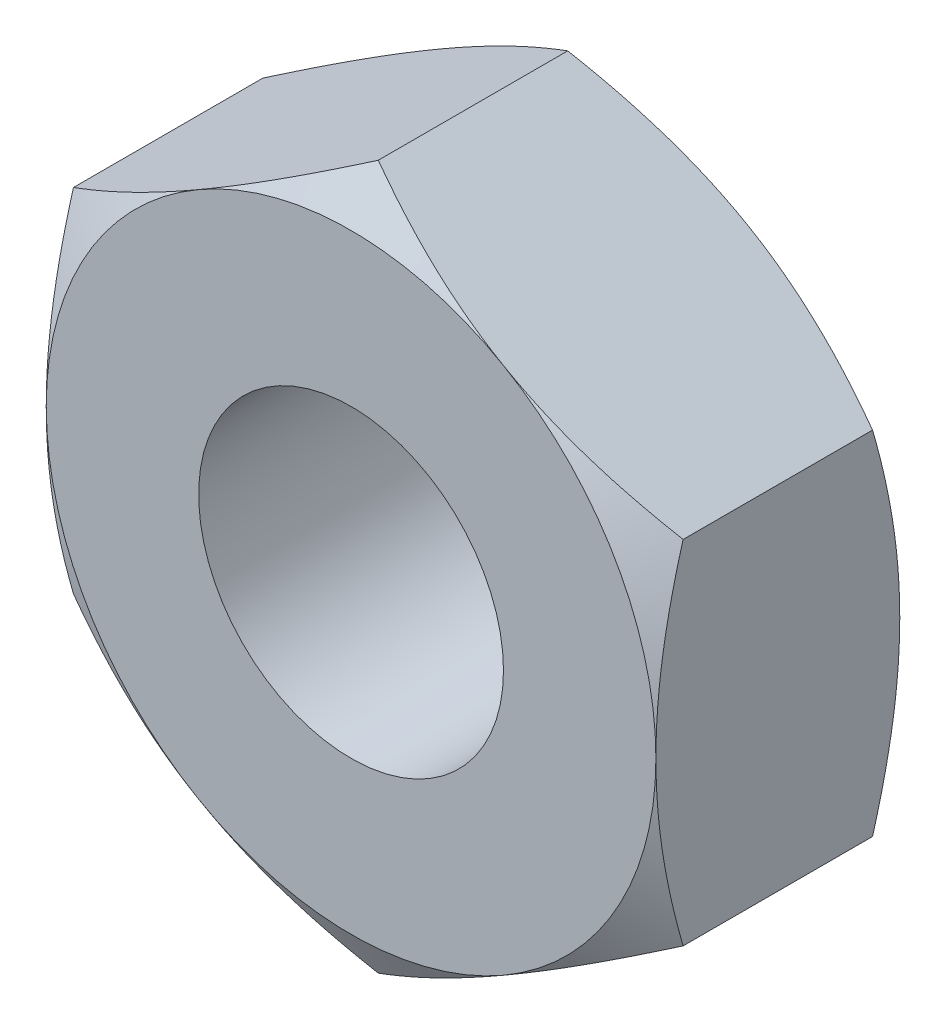
ISO-10303-21;
HEADER;
FILE_DESCRIPTION(('STEP AP214'),'2;1');
FILE_NAME('part.step','',(''),(''),'','','');
FILE_SCHEMA(('AUTOMOTIVE_DESIGN { 1 0 10303 214 1 1 1 1 }'));
ENDSEC;
DATA;
#1=APPLICATION_CONTEXT('core data for automotive mechanical design processes');
#2=APPLICATION_PROTOCOL_DEFINITION('international standard','automotive_design',2000,#1);
#3=PRODUCT_CONTEXT('',#1,'mechanical');
#4=PRODUCT('Part','Part','',(#3));
#5=PRODUCT_RELATED_PRODUCT_CATEGORY('part','',(#4));
#6=PRODUCT_DEFINITION_FORMATION('','',#4);
#7=PRODUCT_DEFINITION_CONTEXT('part definition',#1,'design');
#8=PRODUCT_DEFINITION('design','',#6,#7);
#9=PRODUCT_DEFINITION_SHAPE('','',#8);
#10=(LENGTH_UNIT() NAMED_UNIT(*) SI_UNIT(.MILLI.,.METRE.));
#11=(NAMED_UNIT(*) PLANE_ANGLE_UNIT() SI_UNIT($,.RADIAN.));
#12=(NAMED_UNIT(*) SI_UNIT($,.STERADIAN.) SOLID_ANGLE_UNIT());
#13=UNCERTAINTY_MEASURE_WITH_UNIT(LENGTH_MEASURE(1.E-05),#10,'distance_accuracy_value','');
#14=(GEOMETRIC_REPRESENTATION_CONTEXT(3) GLOBAL_UNCERTAINTY_ASSIGNED_CONTEXT((#13)) GLOBAL_UNIT_ASSIGNED_CONTEXT((#10,
#11,#12)) REPRESENTATION_CONTEXT('',''));
#15=CARTESIAN_POINT('',(0.,0.,0.));
#16=DIRECTION('',(0.,0.,1.));
#17=DIRECTION('',(1.,0.,0.));
#18=AXIS2_PLACEMENT_3D('',#15,#16,#17);
#19=CARTESIAN_POINT('',(0.,0.,-0.8));
#20=DIRECTION('',(0.,0.,1.));
#21=DIRECTION('',(1.,0.,0.));
#22=AXIS2_PLACEMENT_3D('',#19,#20,#21);
#23=PLANE('',#22);
#24=CARTESIAN_POINT('',(0.,0.,-0.8));
#25=DIRECTION('',(0.,0.,1.));
#26=DIRECTION('',(1.,0.,0.));
#27=AXIS2_PLACEMENT_3D('',#24,#25,#26);
#28=CIRCLE('',#27,1.);
#29=CARTESIAN_POINT('',(1.,0.,-0.8));
#30=VERTEX_POINT('',#29);
#31=EDGE_CURVE('E268',#30,#30,#28,.T.);
#32=ORIENTED_EDGE('',*,*,#31,.T.);
#33=EDGE_LOOP('',(#32));
#34=FACE_BOUND('',#33,.T.);
#35=CARTESIAN_POINT('',(0.,0.,-0.8));
#36=DIRECTION('',(0.,0.,1.));
#37=DIRECTION('',(1.,0.,0.));
#38=AXIS2_PLACEMENT_3D('',#35,#36,#37);
#39=CIRCLE('',#38,2.);
#40=CARTESIAN_POINT('',(2.,0.,-0.8));
#41=VERTEX_POINT('',#40);
#42=CARTESIAN_POINT('',(1.,1.73205080756888,-0.8));
#43=VERTEX_POINT('',#42);
#44=EDGE_CURVE('E148',#41,#43,#39,.T.);
#45=ORIENTED_EDGE('',*,*,#44,.F.);
#46=CARTESIAN_POINT('',(0.,0.,-0.8));
#47=DIRECTION('',(0.,0.,1.));
#48=DIRECTION('',(1.,0.,0.));
#49=AXIS2_PLACEMENT_3D('',#46,#47,#48);
#50=CIRCLE('',#49,2.);
#51=CARTESIAN_POINT('',(1.,-1.73205080756888,-0.8));
#52=VERTEX_POINT('',#51);
#53=EDGE_CURVE('E12',#41,#52,#50,.F.);
#54=ORIENTED_EDGE('',*,*,#53,.T.);
#55=CARTESIAN_POINT('',(-1.,-1.73205080756888,-0.8));
#56=VERTEX_POINT('',#55);
#57=EDGE_CURVE('E55',#52,#56,#50,.F.);
#58=ORIENTED_EDGE('',*,*,#57,.T.);
#59=CARTESIAN_POINT('',(-2.,0.,-0.8));
#60=VERTEX_POINT('',#59);
#61=EDGE_CURVE('E368',#56,#60,#50,.F.);
#62=ORIENTED_EDGE('',*,*,#61,.T.);
#63=CARTESIAN_POINT('',(-1.,1.73205080756888,-0.8));
#64=VERTEX_POINT('',#63);
#65=EDGE_CURVE('E157',#60,#64,#50,.F.);
#66=ORIENTED_EDGE('',*,*,#65,.T.);
#67=EDGE_CURVE('E56',#64,#43,#50,.F.);
#68=ORIENTED_EDGE('',*,*,#67,.T.);
#69=EDGE_LOOP('',(#45,#54,#58,#62,#66,#68));
#70=FACE_BOUND('',#69,.T.);
#71=ADVANCED_FACE('F45',(#34,#70),#23,.F.);
#72=CARTESIAN_POINT('',(0.,0.,0.8));
#73=DIRECTION('',(0.,0.,1.));
#74=DIRECTION('',(1.,0.,0.));
#75=AXIS2_PLACEMENT_3D('',#72,#73,#74);
#76=PLANE('',#75);
#77=CARTESIAN_POINT('',(0.,0.,0.8));
#78=DIRECTION('',(0.,0.,1.));
#79=DIRECTION('',(1.,0.,0.));
#80=AXIS2_PLACEMENT_3D('',#77,#78,#79);
#81=CIRCLE('',#80,1.);
#82=CARTESIAN_POINT('',(1.,0.,0.8));
#83=VERTEX_POINT('',#82);
#84=EDGE_CURVE('E272',#83,#83,#81,.T.);
#85=ORIENTED_EDGE('',*,*,#84,.F.);
#86=EDGE_LOOP('',(#85));
#87=FACE_BOUND('',#86,.T.);
#88=CARTESIAN_POINT('',(0.,0.,0.8));
#89=DIRECTION('',(0.,0.,1.));
#90=DIRECTION('',(1.,0.,0.));
#91=AXIS2_PLACEMENT_3D('',#88,#89,#90);
#92=CIRCLE('',#91,2.);
#93=CARTESIAN_POINT('',(1.,-1.73205080756888,0.8));
#94=VERTEX_POINT('',#93);
#95=CARTESIAN_POINT('',(2.,0.,0.8));
#96=VERTEX_POINT('',#95);
#97=EDGE_CURVE('E165',#94,#96,#92,.T.);
#98=ORIENTED_EDGE('',*,*,#97,.T.);
#99=CARTESIAN_POINT('',(1.,1.73205080756888,0.8));
#100=VERTEX_POINT('',#99);
#101=EDGE_CURVE('E170',#96,#100,#92,.T.);
#102=ORIENTED_EDGE('',*,*,#101,.T.);
#103=CARTESIAN_POINT('',(-1.,1.73205080756888,0.8));
#104=VERTEX_POINT('',#103);
#105=EDGE_CURVE('E331',#100,#104,#92,.T.);
#106=ORIENTED_EDGE('',*,*,#105,.T.);
#107=CARTESIAN_POINT('',(-2.,0.,0.8));
#108=VERTEX_POINT('',#107);
#109=EDGE_CURVE('E336',#104,#108,#92,.T.);
#110=ORIENTED_EDGE('',*,*,#109,.T.);
#111=CARTESIAN_POINT('',(-0.999999999999999,-1.73205080756888,0.8));
#112=VERTEX_POINT('',#111);
#113=EDGE_CURVE('E339',#108,#112,#92,.T.);
#114=ORIENTED_EDGE('',*,*,#113,.T.);
#115=EDGE_CURVE('E168',#112,#94,#92,.T.);
#116=ORIENTED_EDGE('',*,*,#115,.T.);
#117=EDGE_LOOP('',(#98,#102,#106,#110,#114,#116));
#118=FACE_BOUND('',#117,.T.);
#119=ADVANCED_FACE('F309',(#87,#118),#76,.T.);
#120=CARTESIAN_POINT('',(2.,1.15470053837925,0.8));
#121=DIRECTION('',(-0.499999999999999,-0.866025403784439,0.));
#122=DIRECTION('',(0.866025403784439,-0.5,0.));
#123=AXIS2_PLACEMENT_3D('',#120,#121,#122);
#124=PLANE('',#123);
#125=DIRECTION('',(0.,0.,-1.));
#126=VECTOR('',#125,1.);
#127=CARTESIAN_POINT('',(2.,1.15470053837925,0.8));
#128=LINE('',#127,#126);
#129=CARTESIAN_POINT('',(2.,1.15470053837925,0.621367205045921));
#130=VERTEX_POINT('',#129);
#131=CARTESIAN_POINT('',(2.,1.15470053837925,-0.621367205045921));
#132=VERTEX_POINT('',#131);
#133=EDGE_CURVE('E163',#130,#132,#128,.T.);
#134=ORIENTED_EDGE('',*,*,#133,.T.);
#135=CARTESIAN_POINT('',(2.0002,1.15458506832542,-0.621300533379505));
#136=CARTESIAN_POINT('',(1.91230873709994,1.20532911262018,-0.650610463899324));
#137=CARTESIAN_POINT('',(1.82365880552641,1.2565111744778,-0.677267148019535));
#138=CARTESIAN_POINT('',(1.6448237530022,1.3597616401932,-0.723797508979281));
#139=CARTESIAN_POINT('',(1.55463545349496,1.41183187919145,-0.743654723617223));
#140=CARTESIAN_POINT('',(1.37537661423669,1.51532701829183,-0.774566535976749));
#141=CARTESIAN_POINT('',(1.28633366177369,1.56673599086578,-0.785826848401471));
#142=CARTESIAN_POINT('',(1.10782860221496,1.66979593505373,-0.79927133740536));
#143=CARTESIAN_POINT('',(1.01836714429604,1.72144653186531,-0.801466645046534));
#144=CARTESIAN_POINT('',(0.851191646451201,1.81796535054794,-0.796909010669353));
#145=CARTESIAN_POINT('',(0.773452629734215,1.86284799277603,-0.791275125312987));
#146=CARTESIAN_POINT('',(0.618481085463865,1.95232085557725,-0.773416104739173));
#147=CARTESIAN_POINT('',(0.5412490942588,1.99691076648954,-0.761184863976562));
#148=CARTESIAN_POINT('',(0.385957813517797,2.08656822922816,-0.730606563132391));
#149=CARTESIAN_POINT('',(0.307918186892618,2.13162442866767,-0.712129832934285));
#150=CARTESIAN_POINT('',(0.153003134307863,2.221064675979,-0.670194481787146));
#151=CARTESIAN_POINT('',(0.0761257223768775,2.26544987045196,-0.646745719507688));
#152=CARTESIAN_POINT('',(-0.000200000000002885,2.30951654681234,-0.621300533379504));
#153=B_SPLINE_CURVE_WITH_KNOTS('',3,(#135,#136,#137,#138,#139,#140,#141,#142,#143,#144,#145,
#146,#147,#148,#149,#150,#151,#152),.UNSPECIFIED.,.F.,.F.,(4,2,2,2,2,2,2,2,4),(0.,
0.31703182469561,0.634825876346563,0.944753967652636,1.25430138000371,1.52387047293094,
1.79368946861028,2.06949491027634,2.34475850821472),.UNSPECIFIED.);
#154=EDGE_CURVE('E68',#132,#43,#153,.T.);
#155=ORIENTED_EDGE('',*,*,#154,.T.);
#156=CARTESIAN_POINT('',(0.,2.3094010767585,-0.62136720504592));
#157=VERTEX_POINT('',#156);
#158=EDGE_CURVE('E136',#43,#157,#153,.T.);
#159=ORIENTED_EDGE('',*,*,#158,.T.);
#160=DIRECTION('',(0.,0.,-1.));
#161=VECTOR('',#160,1.);
#162=CARTESIAN_POINT('',(0.,2.3094010767585,0.8));
#163=LINE('',#162,#161);
#164=CARTESIAN_POINT('',(0.,2.3094010767585,0.62136720504592));
#165=VERTEX_POINT('',#164);
#166=EDGE_CURVE('E294',#165,#157,#163,.T.);
#167=ORIENTED_EDGE('',*,*,#166,.F.);
#168=CARTESIAN_POINT('',(2.0002,1.15458506832542,0.621300533379505));
#169=CARTESIAN_POINT('',(1.91230873709994,1.20532911262018,0.650610463899324));
#170=CARTESIAN_POINT('',(1.82365880552641,1.2565111744778,0.677267148019535));
#171=CARTESIAN_POINT('',(1.6448237530022,1.3597616401932,0.723797508979281));
#172=CARTESIAN_POINT('',(1.55463545349496,1.41183187919145,0.743654723617223));
#173=CARTESIAN_POINT('',(1.37537661423669,1.51532701829183,0.774566535976749));
#174=CARTESIAN_POINT('',(1.28633366177369,1.56673599086578,0.785826848401471));
#175=CARTESIAN_POINT('',(1.10782860221496,1.66979593505373,0.79927133740536));
#176=CARTESIAN_POINT('',(1.01836714429604,1.72144653186531,0.801466645046534));
#177=CARTESIAN_POINT('',(0.851191646451201,1.81796535054794,0.796909010669353));
#178=CARTESIAN_POINT('',(0.773452629734215,1.86284799277603,0.791275125312987));
#179=CARTESIAN_POINT('',(0.618481085463865,1.95232085557725,0.773416104739173));
#180=CARTESIAN_POINT('',(0.5412490942588,1.99691076648954,0.761184863976562));
#181=CARTESIAN_POINT('',(0.385957813517797,2.08656822922816,0.730606563132391));
#182=CARTESIAN_POINT('',(0.307918186892618,2.13162442866767,0.712129832934285));
#183=CARTESIAN_POINT('',(0.153003134307863,2.221064675979,0.670194481787146));
#184=CARTESIAN_POINT('',(0.0761257223768775,2.26544987045196,0.646745719507688));
#185=CARTESIAN_POINT('',(-0.000200000000002885,2.30951654681234,0.621300533379504));
#186=B_SPLINE_CURVE_WITH_KNOTS('',3,(#168,#169,#170,#171,#172,#173,#174,#175,#176,#177,#178,
#179,#180,#181,#182,#183,#184,#185),.UNSPECIFIED.,.F.,.F.,(4,2,2,2,2,2,2,2,4),(0.,
0.31703182469561,0.634825876346563,0.944753967652636,1.25430138000371,1.52387047293094,
1.79368946861028,2.06949491027634,2.34475850821472),.UNSPECIFIED.);
#187=EDGE_CURVE('E260',#100,#165,#186,.T.);
#188=ORIENTED_EDGE('',*,*,#187,.F.);
#189=EDGE_CURVE('E267',#130,#100,#186,.T.);
#190=ORIENTED_EDGE('',*,*,#189,.F.);
#191=EDGE_LOOP('',(#134,#155,#159,#167,#188,#190));
#192=FACE_BOUND('',#191,.T.);
#193=ADVANCED_FACE('F47',(#192),#124,.F.);
#194=CARTESIAN_POINT('',(0.,2.3094010767585,0.8));
#195=DIRECTION('',(0.5,-0.866025403784438,0.));
#196=DIRECTION('',(0.866025403784439,0.5,0.));
#197=AXIS2_PLACEMENT_3D('',#194,#195,#196);
#198=PLANE('',#197);
#199=ORIENTED_EDGE('',*,*,#166,.T.);
#200=CARTESIAN_POINT('',(0.000199999999997243,2.30951654681234,-0.621300533379504));
#201=CARTESIAN_POINT('',(-0.0876912629000628,2.25877250251758,-0.650610463899322));
#202=CARTESIAN_POINT('',(-0.176341194473594,2.20759044065996,-0.677267148019534));
#203=CARTESIAN_POINT('',(-0.355176246997805,2.10433997494456,-0.72379750897928));
#204=CARTESIAN_POINT('',(-0.44536454650504,2.05226973594631,-0.743654723617222));
#205=CARTESIAN_POINT('',(-0.624623385763309,1.94877459684592,-0.774566535976749));
#206=CARTESIAN_POINT('',(-0.713666338226307,1.89736562427197,-0.78582684840147));
#207=CARTESIAN_POINT('',(-0.892171397785046,1.79430568008403,-0.799271337405359));
#208=CARTESIAN_POINT('',(-0.981632855703961,1.74265508327244,-0.801466645046533));
#209=CARTESIAN_POINT('',(-1.1488083535488,1.64613626458981,-0.796909010669352));
#210=CARTESIAN_POINT('',(-1.22654737026579,1.60125362236173,-0.791275125312986));
#211=CARTESIAN_POINT('',(-1.38151891453614,1.51178075956051,-0.773416104739172));
#212=CARTESIAN_POINT('',(-1.4587509057412,1.46719084864821,-0.761184863976561));
#213=CARTESIAN_POINT('',(-1.6140421864822,1.37753338590959,-0.730606563132391));
#214=CARTESIAN_POINT('',(-1.69208181310738,1.33247718647009,-0.712129832934285));
#215=CARTESIAN_POINT('',(-1.84699686569214,1.24303693915875,-0.670194481787145));
#216=CARTESIAN_POINT('',(-1.92387427762312,1.1986517446858,-0.646745719507687));
#217=CARTESIAN_POINT('',(-2.0002,1.15458506832541,-0.621300533379503));
#218=B_SPLINE_CURVE_WITH_KNOTS('',3,(#200,#201,#202,#203,#204,#205,#206,#207,#208,#209,#210,
#211,#212,#213,#214,#215,#216,#217),.UNSPECIFIED.,.F.,.F.,(4,2,2,2,2,2,2,2,4),(0.,
0.31703182469561,0.634825876346564,0.944753967652636,1.25430138000371,1.52387047293094,
1.79368946861028,2.06949491027634,2.34475850821473),.UNSPECIFIED.);
#219=EDGE_CURVE('E141',#157,#64,#218,.T.);
#220=ORIENTED_EDGE('',*,*,#219,.T.);
#221=CARTESIAN_POINT('',(-2.,1.15470053837925,-0.62136720504592));
#222=VERTEX_POINT('',#221);
#223=EDGE_CURVE('E177',#64,#222,#218,.T.);
#224=ORIENTED_EDGE('',*,*,#223,.T.);
#225=DIRECTION('',(0.,0.,-1.));
#226=VECTOR('',#225,1.);
#227=CARTESIAN_POINT('',(-2.,1.15470053837925,0.8));
#228=LINE('',#227,#226);
#229=CARTESIAN_POINT('',(-2.,1.15470053837925,0.62136720504592));
#230=VERTEX_POINT('',#229);
#231=EDGE_CURVE('E290',#230,#222,#228,.T.);
#232=ORIENTED_EDGE('',*,*,#231,.F.);
#233=CARTESIAN_POINT('',(0.000199999999997243,2.30951654681234,0.621300533379504));
#234=CARTESIAN_POINT('',(-0.0876912629000628,2.25877250251758,0.650610463899322));
#235=CARTESIAN_POINT('',(-0.176341194473594,2.20759044065996,0.677267148019534));
#236=CARTESIAN_POINT('',(-0.355176246997805,2.10433997494456,0.72379750897928));
#237=CARTESIAN_POINT('',(-0.44536454650504,2.05226973594631,0.743654723617222));
#238=CARTESIAN_POINT('',(-0.624623385763309,1.94877459684592,0.774566535976749));
#239=CARTESIAN_POINT('',(-0.713666338226307,1.89736562427197,0.78582684840147));
#240=CARTESIAN_POINT('',(-0.892171397785046,1.79430568008403,0.799271337405359));
#241=CARTESIAN_POINT('',(-0.981632855703961,1.74265508327244,0.801466645046533));
#242=CARTESIAN_POINT('',(-1.1488083535488,1.64613626458981,0.796909010669352));
#243=CARTESIAN_POINT('',(-1.22654737026579,1.60125362236173,0.791275125312986));
#244=CARTESIAN_POINT('',(-1.38151891453614,1.51178075956051,0.773416104739172));
#245=CARTESIAN_POINT('',(-1.4587509057412,1.46719084864821,0.761184863976561));
#246=CARTESIAN_POINT('',(-1.6140421864822,1.37753338590959,0.730606563132391));
#247=CARTESIAN_POINT('',(-1.69208181310738,1.33247718647009,0.712129832934285));
#248=CARTESIAN_POINT('',(-1.84699686569214,1.24303693915875,0.670194481787145));
#249=CARTESIAN_POINT('',(-1.92387427762312,1.1986517446858,0.646745719507687));
#250=CARTESIAN_POINT('',(-2.0002,1.15458506832541,0.621300533379503));
#251=B_SPLINE_CURVE_WITH_KNOTS('',3,(#233,#234,#235,#236,#237,#238,#239,#240,#241,#242,#243,
#244,#245,#246,#247,#248,#249,#250),.UNSPECIFIED.,.F.,.F.,(4,2,2,2,2,2,2,2,4),(0.,
0.31703182469561,0.634825876346564,0.944753967652636,1.25430138000371,1.52387047293094,
1.79368946861028,2.06949491027634,2.34475850821473),.UNSPECIFIED.);
#252=EDGE_CURVE('E252',#104,#230,#251,.T.);
#253=ORIENTED_EDGE('',*,*,#252,.F.);
#254=EDGE_CURVE('E259',#165,#104,#251,.T.);
#255=ORIENTED_EDGE('',*,*,#254,.F.);
#256=EDGE_LOOP('',(#199,#220,#224,#232,#253,#255));
#257=FACE_BOUND('',#256,.T.);
#258=ADVANCED_FACE('F231',(#257),#198,.F.);
#259=CARTESIAN_POINT('',(-2.,1.15470053837925,0.8));
#260=DIRECTION('',(1.,0.,0.));
#261=DIRECTION('',(0.,1.,0.));
#262=AXIS2_PLACEMENT_3D('',#259,#260,#261);
#263=PLANE('',#262);
#264=ORIENTED_EDGE('',*,*,#231,.T.);
#265=CARTESIAN_POINT('',(-2.,-3.14743047654047,0.198306552850416));
#266=CARTESIAN_POINT('',(-2.,-3.05967210244813,0.15555386897695));
#267=CARTESIAN_POINT('',(-2.,-2.97171709984303,0.11319812528014));
#268=CARTESIAN_POINT('',(-2.,-2.7953094200198,0.0295029218520008));
#269=CARTESIAN_POINT('',(-2.,-2.70685667089522,-0.011836386155036));
#270=CARTESIAN_POINT('',(-2.,-2.52891504543683,-0.0934745468336394));
#271=CARTESIAN_POINT('',(-2.,-2.43942317489823,-0.133766894988964));
#272=CARTESIAN_POINT('',(-2.,-2.25974335517449,-0.212762396383481));
#273=CARTESIAN_POINT('',(-2.,-2.16955543783014,-0.251465621811494));
#274=CARTESIAN_POINT('',(-2.,-1.98527196879578,-0.328141363705161));
#275=CARTESIAN_POINT('',(-2.,-1.89114750628804,-0.366044763197896));
#276=CARTESIAN_POINT('',(-2.,-1.70183294408364,-0.439084605273417));
#277=CARTESIAN_POINT('',(-2.,-1.60664293762428,-0.474221287821165));
#278=CARTESIAN_POINT('',(-2.,-1.41518203816934,-0.540850496108786));
#279=CARTESIAN_POINT('',(-2.,-1.31891348177164,-0.57234967065767));
#280=CARTESIAN_POINT('',(-2.,-1.12499622861149,-0.630719653237133));
#281=CARTESIAN_POINT('',(-2.,-1.0273479620753,-0.657591871040156));
#282=CARTESIAN_POINT('',(-2.,-0.831155178970935,-0.705306142874815));
#283=CARTESIAN_POINT('',(-2.,-0.732618998809863,-0.726181852738164));
#284=CARTESIAN_POINT('',(-2.,-0.534275684214462,-0.760753391420456));
#285=CARTESIAN_POINT('',(-2.,-0.434468688672748,-0.774449998089522));
#286=CARTESIAN_POINT('',(-2.,-0.235400315881104,-0.793390191057682));
#287=CARTESIAN_POINT('',(-2.,-0.136149929105314,-0.798746020812805));
#288=CARTESIAN_POINT('',(-2.,0.0624411832173024,-0.800861920991029));
#289=CARTESIAN_POINT('',(-2.,0.161781910117855,-0.797621860412019));
#290=CARTESIAN_POINT('',(-2.,0.397385015097488,-0.780019496600155));
#291=CARTESIAN_POINT('',(-2.,0.533369746619372,-0.761906918753454));
#292=CARTESIAN_POINT('',(-2.,0.80295075132916,-0.71262576705023));
#293=CARTESIAN_POINT('',(-2.,0.936544747020601,-0.681445369779726));
#294=CARTESIAN_POINT('',(-2.,1.20415328853255,-0.608631407271917));
#295=CARTESIAN_POINT('',(-2.,1.33810419419207,-0.566769802383892));
#296=CARTESIAN_POINT('',(-2.,1.53715171848284,-0.498678676980695));
#297=CARTESIAN_POINT('',(-2.,1.60318282855603,-0.475100500137475));
#298=CARTESIAN_POINT('',(-2.,1.73469382343811,-0.426454140842531));
#299=CARTESIAN_POINT('',(-2.,1.80017372071484,-0.401385992196317));
#300=CARTESIAN_POINT('',(-2.,1.97604049113679,-0.332133085670554));
#301=CARTESIAN_POINT('',(-2.,2.08596811744941,-0.286784871314014));
#302=CARTESIAN_POINT('',(-2.,2.30469384449309,-0.193432023273478));
#303=CARTESIAN_POINT('',(-2.,2.41349182359983,-0.145427107004601));
#304=CARTESIAN_POINT('',(-2.,2.63021356509041,-0.0473911285308214));
#305=CARTESIAN_POINT('',(-2.,2.73813700973349,0.00264063366716404));
#306=CARTESIAN_POINT('',(-2.,2.9532527297254,0.104254973803327));
#307=CARTESIAN_POINT('',(-2.,3.06044498281286,0.155837598701774));
#308=CARTESIAN_POINT('',(-2.,3.38147646251264,0.312545190507859));
#309=CARTESIAN_POINT('',(-2.,3.59443363993267,0.419474740091152));
#310=CARTESIAN_POINT('',(-2.,4.01873866766051,0.63634967467673));
#311=CARTESIAN_POINT('',(-2.,4.2300868435542,0.746294427639898));
#312=CARTESIAN_POINT('',(-2.,4.62945943906715,0.956537342735008));
#313=CARTESIAN_POINT('',(-2.,4.81759240607136,1.05662966634099));
#314=CARTESIAN_POINT('',(-2.,5.19322505857694,1.25802116090653));
#315=CARTESIAN_POINT('',(-2.00000000000001,5.38072470449695,1.35932040556842));
#316=CARTESIAN_POINT('',(-2.00000000000001,5.7546105695392,1.5624739160313));
#317=CARTESIAN_POINT('',(-2.00000000000001,5.94099841514985,1.66432519196928));
#318=CARTESIAN_POINT('',(-2.00000000000001,6.31337850698986,1.86871405091757));
#319=CARTESIAN_POINT('',(-2.00000000000001,6.49937078318764,1.97125157930546));
#320=CARTESIAN_POINT('',(-2.00000000000001,6.68522403643259,2.07403873577321));
#321=B_SPLINE_CURVE_WITH_KNOTS('',3,(#265,#266,#267,#268,#269,#270,#271,#272,#273,#274,#275,
#276,#277,#278,#279,#280,#281,#282,#283,#284,#285,#286,#287,#288,#289,#290,#291,#292,#293,#294,
#295,#296,#297,#298,#299,#300,#301,#302,#303,#304,#305,#306,#307,#308,#309,#310,#311,#312,#313,
#314,#315,#316,#317,#318,#319,#320),.UNSPECIFIED.,.F.,.F.,(4,2,2,2,2,2,2,2,2,2,2,2,2,2,2,2,2,2,
2,2,2,2,2,2,2,2,2,4),(0.,0.292858137509559,0.585759728041967,0.880179690347562,1.17458626325435,
1.47896161268405,1.78331053365848,2.08709403815516,2.39078481942149,2.69273623340005,
2.99465492441654,3.29247440702638,3.59029842845696,4.00100978875949,4.41209355470286,
4.83281993450001,5.04315129430592,5.25347788378898,5.61016899779103,5.96689812507929,
6.32375152082678,6.68061573303353,7.3954562078898,8.110147968096,8.74944811938761,
9.38878751260476,10.0259883790783,10.6631391166861),.UNSPECIFIED.);
#322=EDGE_CURVE('E225',#222,#60,#321,.F.);
#323=ORIENTED_EDGE('',*,*,#322,.T.);
#324=CARTESIAN_POINT('',(-2.,-1.15470053837925,-0.621367205045921));
#325=VERTEX_POINT('',#324);
#326=EDGE_CURVE('E217',#60,#325,#321,.F.);
#327=ORIENTED_EDGE('',*,*,#326,.T.);
#328=DIRECTION('',(0.,0.,-1.));
#329=VECTOR('',#328,1.);
#330=CARTESIAN_POINT('',(-2.,-1.15470053837925,0.8));
#331=LINE('',#330,#329);
#332=CARTESIAN_POINT('',(-2.,-1.15470053837925,0.621367205045921));
#333=VERTEX_POINT('',#332);
#334=EDGE_CURVE('E286',#333,#325,#331,.T.);
#335=ORIENTED_EDGE('',*,*,#334,.F.);
#336=CARTESIAN_POINT('',(-2.,-3.14743047654047,-0.198306552850416));
#337=CARTESIAN_POINT('',(-2.,-3.05967210244813,-0.15555386897695));
#338=CARTESIAN_POINT('',(-2.,-2.97171709984303,-0.11319812528014));
#339=CARTESIAN_POINT('',(-2.,-2.7953094200198,-0.0295029218520008));
#340=CARTESIAN_POINT('',(-2.,-2.70685667089522,0.011836386155036));
#341=CARTESIAN_POINT('',(-2.,-2.52891504543683,0.0934745468336394));
#342=CARTESIAN_POINT('',(-2.,-2.43942317489823,0.133766894988964));
#343=CARTESIAN_POINT('',(-2.,-2.25974335517449,0.212762396383481));
#344=CARTESIAN_POINT('',(-2.,-2.16955543783014,0.251465621811494));
#345=CARTESIAN_POINT('',(-2.,-1.98527196879578,0.328141363705161));
#346=CARTESIAN_POINT('',(-2.,-1.89114750628804,0.366044763197896));
#347=CARTESIAN_POINT('',(-2.,-1.70183294408364,0.439084605273417));
#348=CARTESIAN_POINT('',(-2.,-1.60664293762428,0.474221287821165));
#349=CARTESIAN_POINT('',(-2.,-1.41518203816934,0.540850496108786));
#350=CARTESIAN_POINT('',(-2.,-1.31891348177164,0.57234967065767));
#351=CARTESIAN_POINT('',(-2.,-1.12499622861149,0.630719653237133));
#352=CARTESIAN_POINT('',(-2.,-1.0273479620753,0.657591871040156));
#353=CARTESIAN_POINT('',(-2.,-0.831155178970935,0.705306142874815));
#354=CARTESIAN_POINT('',(-2.,-0.732618998809863,0.726181852738164));
#355=CARTESIAN_POINT('',(-2.,-0.534275684214462,0.760753391420456));
#356=CARTESIAN_POINT('',(-2.,-0.434468688672748,0.774449998089522));
#357=CARTESIAN_POINT('',(-2.,-0.235400315881104,0.793390191057682));
#358=CARTESIAN_POINT('',(-2.,-0.136149929105314,0.798746020812805));
#359=CARTESIAN_POINT('',(-2.,0.0624411832173024,0.800861920991029));
#360=CARTESIAN_POINT('',(-2.,0.161781910117855,0.797621860412019));
#361=CARTESIAN_POINT('',(-2.,0.397385015097488,0.780019496600155));
#362=CARTESIAN_POINT('',(-2.,0.533369746619372,0.761906918753454));
#363=CARTESIAN_POINT('',(-2.,0.80295075132916,0.71262576705023));
#364=CARTESIAN_POINT('',(-2.,0.936544747020601,0.681445369779726));
#365=CARTESIAN_POINT('',(-2.,1.20415328853255,0.608631407271917));
#366=CARTESIAN_POINT('',(-2.,1.33810419419207,0.566769802383892));
#367=CARTESIAN_POINT('',(-2.,1.53715171848284,0.498678676980695));
#368=CARTESIAN_POINT('',(-2.,1.60318282855603,0.475100500137475));
#369=CARTESIAN_POINT('',(-2.,1.73469382343811,0.426454140842531));
#370=CARTESIAN_POINT('',(-2.,1.80017372071484,0.401385992196317));
#371=CARTESIAN_POINT('',(-2.,1.97604049113679,0.332133085670554));
#372=CARTESIAN_POINT('',(-2.,2.08596811744941,0.286784871314014));
#373=CARTESIAN_POINT('',(-2.,2.30469384449309,0.193432023273478));
#374=CARTESIAN_POINT('',(-2.,2.41349182359983,0.145427107004601));
#375=CARTESIAN_POINT('',(-2.,2.63021356509041,0.0473911285308214));
#376=CARTESIAN_POINT('',(-2.,2.73813700973349,-0.00264063366716404));
#377=CARTESIAN_POINT('',(-2.,2.9532527297254,-0.104254973803327));
#378=CARTESIAN_POINT('',(-2.,3.06044498281286,-0.155837598701774));
#379=CARTESIAN_POINT('',(-2.,3.38147646251264,-0.312545190507859));
#380=CARTESIAN_POINT('',(-2.,3.59443363993267,-0.419474740091152));
#381=CARTESIAN_POINT('',(-2.,4.01873866766051,-0.63634967467673));
#382=CARTESIAN_POINT('',(-2.,4.2300868435542,-0.746294427639898));
#383=CARTESIAN_POINT('',(-2.,4.62945943906715,-0.956537342735008));
#384=CARTESIAN_POINT('',(-2.,4.81759240607136,-1.05662966634099));
#385=CARTESIAN_POINT('',(-2.,5.19322505857694,-1.25802116090653));
#386=CARTESIAN_POINT('',(-2.00000000000001,5.38072470449695,-1.35932040556842));
#387=CARTESIAN_POINT('',(-2.00000000000001,5.7546105695392,-1.5624739160313));
#388=CARTESIAN_POINT('',(-2.00000000000001,5.94099841514985,-1.66432519196928));
#389=CARTESIAN_POINT('',(-2.00000000000001,6.31337850698986,-1.86871405091757));
#390=CARTESIAN_POINT('',(-2.00000000000001,6.49937078318764,-1.97125157930546));
#391=CARTESIAN_POINT('',(-2.00000000000001,6.68522403643259,-2.07403873577321));
#392=B_SPLINE_CURVE_WITH_KNOTS('',3,(#336,#337,#338,#339,#340,#341,#342,#343,#344,#345,#346,
#347,#348,#349,#350,#351,#352,#353,#354,#355,#356,#357,#358,#359,#360,#361,#362,#363,#364,#365,
#366,#367,#368,#369,#370,#371,#372,#373,#374,#375,#376,#377,#378,#379,#380,#381,#382,#383,#384,
#385,#386,#387,#388,#389,#390,#391),.UNSPECIFIED.,.F.,.F.,(4,2,2,2,2,2,2,2,2,2,2,2,2,2,2,2,2,2,
2,2,2,2,2,2,2,2,2,4),(0.,0.292858137509559,0.585759728041967,0.880179690347562,1.17458626325435,
1.47896161268405,1.78331053365848,2.08709403815516,2.39078481942149,2.69273623340005,
2.99465492441654,3.29247440702638,3.59029842845696,4.00100978875949,4.41209355470286,
4.83281993450001,5.04315129430592,5.25347788378898,5.61016899779103,5.96689812507929,
6.32375152082678,6.68061573303353,7.3954562078898,8.110147968096,8.74944811938761,
9.38878751260476,10.0259883790783,10.6631391166861),.UNSPECIFIED.);
#393=EDGE_CURVE('E237',#108,#333,#392,.F.);
#394=ORIENTED_EDGE('',*,*,#393,.F.);
#395=EDGE_CURVE('E245',#230,#108,#392,.F.);
#396=ORIENTED_EDGE('',*,*,#395,.F.);
#397=EDGE_LOOP('',(#264,#323,#327,#335,#394,#396));
#398=FACE_BOUND('',#397,.T.);
#399=ADVANCED_FACE('F227',(#398),#263,.F.);
#400=CARTESIAN_POINT('',(-2.,-1.15470053837925,0.8));
#401=DIRECTION('',(0.5,0.866025403784439,0.));
#402=DIRECTION('',(-0.866025403784439,0.5,0.));
#403=AXIS2_PLACEMENT_3D('',#400,#401,#402);
#404=PLANE('',#403);
#405=ORIENTED_EDGE('',*,*,#334,.T.);
#406=CARTESIAN_POINT('',(-2.0002,-1.15458506832541,-0.621300533379504));
#407=CARTESIAN_POINT('',(-1.91230873709994,-1.20532911262018,-0.650610463899323));
#408=CARTESIAN_POINT('',(-1.82365880552641,-1.2565111744778,-0.677267148019535));
#409=CARTESIAN_POINT('',(-1.6448237530022,-1.35976164019319,-0.723797508979281));
#410=CARTESIAN_POINT('',(-1.55463545349497,-1.41183187919145,-0.743654723617223));
#411=CARTESIAN_POINT('',(-1.3753766142367,-1.51532701829183,-0.77456653597675));
#412=CARTESIAN_POINT('',(-1.2863336617737,-1.56673599086578,-0.785826848401471));
#413=CARTESIAN_POINT('',(-1.10782860221496,-1.66979593505373,-0.79927133740536));
#414=CARTESIAN_POINT('',(-1.01836714429604,-1.72144653186531,-0.801466645046535));
#415=CARTESIAN_POINT('',(-0.851191646451204,-1.81796535054794,-0.796909010669354));
#416=CARTESIAN_POINT('',(-0.773452629734218,-1.86284799277603,-0.791275125312988));
#417=CARTESIAN_POINT('',(-0.618481085463868,-1.95232085557725,-0.773416104739175));
#418=CARTESIAN_POINT('',(-0.541249094258803,-1.99691076648954,-0.761184863976564));
#419=CARTESIAN_POINT('',(-0.3859578135178,-2.08656822922816,-0.730606563132393));
#420=CARTESIAN_POINT('',(-0.307918186892621,-2.13162442866767,-0.712129832934287));
#421=CARTESIAN_POINT('',(-0.153003134307865,-2.221064675979,-0.670194481787148));
#422=CARTESIAN_POINT('',(-0.0761257223768798,-2.26544987045196,-0.64674571950769));
#423=CARTESIAN_POINT('',(0.000200000000000639,-2.30951654681234,-0.621300533379505));
#424=B_SPLINE_CURVE_WITH_KNOTS('',3,(#406,#407,#408,#409,#410,#411,#412,#413,#414,#415,#416,
#417,#418,#419,#420,#421,#422,#423),.UNSPECIFIED.,.F.,.F.,(4,2,2,2,2,2,2,2,4),(0.,
0.31703182469561,0.634825876346564,0.944753967652636,1.25430138000371,1.52387047293094,
1.79368946861028,2.06949491027634,2.34475850821473),.UNSPECIFIED.);
#425=EDGE_CURVE('E226',#325,#56,#424,.T.);
#426=ORIENTED_EDGE('',*,*,#425,.T.);
#427=CARTESIAN_POINT('',(0.,-2.3094010767585,-0.621367205045922));
#428=VERTEX_POINT('',#427);
#429=EDGE_CURVE('E211',#56,#428,#424,.T.);
#430=ORIENTED_EDGE('',*,*,#429,.T.);
#431=DIRECTION('',(0.,0.,-1.));
#432=VECTOR('',#431,1.);
#433=CARTESIAN_POINT('',(0.,-2.3094010767585,0.8));
#434=LINE('',#433,#432);
#435=CARTESIAN_POINT('',(0.,-2.3094010767585,0.621367205045922));
#436=VERTEX_POINT('',#435);
#437=EDGE_CURVE('E282',#436,#428,#434,.T.);
#438=ORIENTED_EDGE('',*,*,#437,.F.);
#439=CARTESIAN_POINT('',(-2.0002,-1.15458506832541,0.621300533379504));
#440=CARTESIAN_POINT('',(-1.91230873709994,-1.20532911262018,0.650610463899323));
#441=CARTESIAN_POINT('',(-1.82365880552641,-1.2565111744778,0.677267148019535));
#442=CARTESIAN_POINT('',(-1.6448237530022,-1.35976164019319,0.723797508979281));
#443=CARTESIAN_POINT('',(-1.55463545349497,-1.41183187919145,0.743654723617223));
#444=CARTESIAN_POINT('',(-1.3753766142367,-1.51532701829183,0.77456653597675));
#445=CARTESIAN_POINT('',(-1.2863336617737,-1.56673599086578,0.785826848401471));
#446=CARTESIAN_POINT('',(-1.10782860221496,-1.66979593505373,0.79927133740536));
#447=CARTESIAN_POINT('',(-1.01836714429604,-1.72144653186531,0.801466645046535));
#448=CARTESIAN_POINT('',(-0.851191646451204,-1.81796535054794,0.796909010669354));
#449=CARTESIAN_POINT('',(-0.773452629734218,-1.86284799277603,0.791275125312988));
#450=CARTESIAN_POINT('',(-0.618481085463868,-1.95232085557725,0.773416104739175));
#451=CARTESIAN_POINT('',(-0.541249094258803,-1.99691076648954,0.761184863976564));
#452=CARTESIAN_POINT('',(-0.3859578135178,-2.08656822922816,0.730606563132393));
#453=CARTESIAN_POINT('',(-0.307918186892621,-2.13162442866767,0.712129832934287));
#454=CARTESIAN_POINT('',(-0.153003134307865,-2.221064675979,0.670194481787148));
#455=CARTESIAN_POINT('',(-0.0761257223768798,-2.26544987045196,0.64674571950769));
#456=CARTESIAN_POINT('',(0.000200000000000639,-2.30951654681234,0.621300533379505));
#457=B_SPLINE_CURVE_WITH_KNOTS('',3,(#439,#440,#441,#442,#443,#444,#445,#446,#447,#448,#449,
#450,#451,#452,#453,#454,#455,#456),.UNSPECIFIED.,.F.,.F.,(4,2,2,2,2,2,2,2,4),(0.,
0.31703182469561,0.634825876346564,0.944753967652636,1.25430138000371,1.52387047293094,
1.79368946861028,2.06949491027634,2.34475850821473),.UNSPECIFIED.);
#458=EDGE_CURVE('E247',#112,#436,#457,.T.);
#459=ORIENTED_EDGE('',*,*,#458,.F.);
#460=EDGE_CURVE('E246',#333,#112,#457,.T.);
#461=ORIENTED_EDGE('',*,*,#460,.F.);
#462=EDGE_LOOP('',(#405,#426,#430,#438,#459,#461));
#463=FACE_BOUND('',#462,.T.);
#464=ADVANCED_FACE('F230',(#463),#404,.F.);
#465=CARTESIAN_POINT('',(0.,-2.3094010767585,0.8));
#466=DIRECTION('',(-0.5,0.866025403784438,0.));
#467=DIRECTION('',(-0.866025403784439,-0.5,0.));
#468=AXIS2_PLACEMENT_3D('',#465,#466,#467);
#469=PLANE('',#468);
#470=ORIENTED_EDGE('',*,*,#437,.T.);
#471=CARTESIAN_POINT('',(-0.000199999999999333,-2.30951654681234,-0.621300533379505));
#472=CARTESIAN_POINT('',(0.0876912629000606,-2.25877250251757,-0.650610463899324));
#473=CARTESIAN_POINT('',(0.176341194473592,-2.20759044065995,-0.677267148019536));
#474=CARTESIAN_POINT('',(0.355176246997802,-2.10433997494456,-0.723797508979282));
#475=CARTESIAN_POINT('',(0.445364546505037,-2.0522697359463,-0.743654723617224));
#476=CARTESIAN_POINT('',(0.624623385763306,-1.94877459684592,-0.77456653597675));
#477=CARTESIAN_POINT('',(0.713666338226304,-1.89736562427197,-0.785826848401471));
#478=CARTESIAN_POINT('',(0.892171397785043,-1.79430568008402,-0.79927133740536));
#479=CARTESIAN_POINT('',(0.981632855703958,-1.74265508327244,-0.801466645046534));
#480=CARTESIAN_POINT('',(1.1488083535488,-1.64613626458981,-0.796909010669354));
#481=CARTESIAN_POINT('',(1.22654737026578,-1.60125362236172,-0.791275125312988));
#482=CARTESIAN_POINT('',(1.38151891453613,-1.51178075956051,-0.773416104739174));
#483=CARTESIAN_POINT('',(1.4587509057412,-1.46719084864821,-0.761184863976563));
#484=CARTESIAN_POINT('',(1.6140421864822,-1.37753338590959,-0.730606563132393));
#485=CARTESIAN_POINT('',(1.69208181310738,-1.33247718647009,-0.712129832934287));
#486=CARTESIAN_POINT('',(1.84699686569214,-1.24303693915875,-0.670194481787147));
#487=CARTESIAN_POINT('',(1.92387427762312,-1.1986517446858,-0.646745719507689));
#488=CARTESIAN_POINT('',(2.0002,-1.15458506832541,-0.621300533379505));
#489=B_SPLINE_CURVE_WITH_KNOTS('',3,(#471,#472,#473,#474,#475,#476,#477,#478,#479,#480,#481,
#482,#483,#484,#485,#486,#487,#488),.UNSPECIFIED.,.F.,.F.,(4,2,2,2,2,2,2,2,4),(0.,
0.31703182469561,0.634825876346563,0.944753967652635,1.25430138000371,1.52387047293094,
1.79368946861028,2.06949491027634,2.34475850821472),.UNSPECIFIED.);
#490=EDGE_CURVE('E380',#428,#52,#489,.T.);
#491=ORIENTED_EDGE('',*,*,#490,.T.);
#492=CARTESIAN_POINT('',(2.,-1.15470053837935,-0.621367205045986));
#493=VERTEX_POINT('',#492);
#494=EDGE_CURVE('E204',#52,#493,#489,.T.);
#495=ORIENTED_EDGE('',*,*,#494,.T.);
#496=DIRECTION('',(0.,0.,-1.));
#497=VECTOR('',#496,1.);
#498=CARTESIAN_POINT('',(2.,-1.15470053837925,0.8));
#499=LINE('',#498,#497);
#500=CARTESIAN_POINT('',(2.,-1.15470053837935,0.621367205045986));
#501=VERTEX_POINT('',#500);
#502=EDGE_CURVE('E278',#501,#493,#499,.T.);
#503=ORIENTED_EDGE('',*,*,#502,.F.);
#504=CARTESIAN_POINT('',(-0.000199999999999333,-2.30951654681234,0.621300533379505));
#505=CARTESIAN_POINT('',(0.0876912629000606,-2.25877250251757,0.650610463899324));
#506=CARTESIAN_POINT('',(0.176341194473592,-2.20759044065995,0.677267148019536));
#507=CARTESIAN_POINT('',(0.355176246997802,-2.10433997494456,0.723797508979282));
#508=CARTESIAN_POINT('',(0.445364546505037,-2.0522697359463,0.743654723617224));
#509=CARTESIAN_POINT('',(0.624623385763306,-1.94877459684592,0.77456653597675));
#510=CARTESIAN_POINT('',(0.713666338226304,-1.89736562427197,0.785826848401471));
#511=CARTESIAN_POINT('',(0.892171397785043,-1.79430568008402,0.79927133740536));
#512=CARTESIAN_POINT('',(0.981632855703958,-1.74265508327244,0.801466645046534));
#513=CARTESIAN_POINT('',(1.1488083535488,-1.64613626458981,0.796909010669354));
#514=CARTESIAN_POINT('',(1.22654737026578,-1.60125362236172,0.791275125312988));
#515=CARTESIAN_POINT('',(1.38151891453613,-1.51178075956051,0.773416104739174));
#516=CARTESIAN_POINT('',(1.4587509057412,-1.46719084864821,0.761184863976563));
#517=CARTESIAN_POINT('',(1.6140421864822,-1.37753338590959,0.730606563132393));
#518=CARTESIAN_POINT('',(1.69208181310738,-1.33247718647009,0.712129832934287));
#519=CARTESIAN_POINT('',(1.84699686569214,-1.24303693915875,0.670194481787147));
#520=CARTESIAN_POINT('',(1.92387427762312,-1.1986517446858,0.646745719507689));
#521=CARTESIAN_POINT('',(2.0002,-1.15458506832541,0.621300533379505));
#522=B_SPLINE_CURVE_WITH_KNOTS('',3,(#504,#505,#506,#507,#508,#509,#510,#511,#512,#513,#514,
#515,#516,#517,#518,#519,#520,#521),.UNSPECIFIED.,.F.,.F.,(4,2,2,2,2,2,2,2,4),(0.,
0.31703182469561,0.634825876346563,0.944753967652635,1.25430138000371,1.52387047293094,
1.79368946861028,2.06949491027634,2.34475850821472),.UNSPECIFIED.);
#523=EDGE_CURVE('E316',#94,#501,#522,.T.);
#524=ORIENTED_EDGE('',*,*,#523,.F.);
#525=EDGE_CURVE('E322',#436,#94,#522,.T.);
#526=ORIENTED_EDGE('',*,*,#525,.F.);
#527=EDGE_LOOP('',(#470,#491,#495,#503,#524,#526));
#528=FACE_BOUND('',#527,.T.);
#529=ADVANCED_FACE('F307',(#528),#469,.F.);
#530=CARTESIAN_POINT('',(2.,-1.15470053837925,0.8));
#531=DIRECTION('',(-1.,0.,0.));
#532=DIRECTION('',(0.,-1.,0.));
#533=AXIS2_PLACEMENT_3D('',#530,#531,#532);
#534=PLANE('',#533);
#535=ORIENTED_EDGE('',*,*,#502,.T.);
#536=CARTESIAN_POINT('',(2.,-3.14743047830184,0.198306553708717));
#537=CARTESIAN_POINT('',(2.,-3.0596721041502,0.155553869799481));
#538=CARTESIAN_POINT('',(2.,-2.97171710148575,0.113198126066922));
#539=CARTESIAN_POINT('',(2.,-2.79530942154365,0.0295029225674567));
#540=CARTESIAN_POINT('',(2.,-2.70685667235954,-0.0118363854751567));
#541=CARTESIAN_POINT('',(2.,-2.52891504678121,-0.0934745462249311));
#542=CARTESIAN_POINT('',(2.,-2.43942317618218,-0.133766894415844));
#543=CARTESIAN_POINT('',(2.,-2.25974335633718,-0.212762395880951));
#544=CARTESIAN_POINT('',(2.,-2.169555438932,-0.251465621343967));
#545=CARTESIAN_POINT('',(2.,-1.98527196977116,-0.328141363308712));
#546=CARTESIAN_POINT('',(2.,-1.89114750719773,-0.366044762837439));
#547=CARTESIAN_POINT('',(2.,-1.70183294486092,-0.439084604983026));
#548=CARTESIAN_POINT('',(2.,-1.60664293833485,-0.474221287564847));
#549=CARTESIAN_POINT('',(2.,-1.41518203874523,-0.540850495917394));
#550=CARTESIAN_POINT('',(2.,-1.31891348227958,-0.572349670497139));
#551=CARTESIAN_POINT('',(2.,-1.12499622898168,-0.630719653133339));
#552=CARTESIAN_POINT('',(2.,-1.02734796237569,-0.65759187096224));
#553=CARTESIAN_POINT('',(2.,-0.831155179096225,-0.705306142849173));
#554=CARTESIAN_POINT('',(2.,-0.732618998829365,-0.726181852736954));
#555=CARTESIAN_POINT('',(2.,-0.534275684019802,-0.760753391452203));
#556=CARTESIAN_POINT('',(2.,-0.434468688369716,-0.774449998129806));
#557=CARTESIAN_POINT('',(2.,-0.235400315363096,-0.793390191095696));
#558=CARTESIAN_POINT('',(2.,-0.136149928480724,-0.798746020840374));
#559=CARTESIAN_POINT('',(2.,0.0624411840534578,-0.800861920979002));
#560=CARTESIAN_POINT('',(2.,0.161781911058995,-0.797621860370836));
#561=CARTESIAN_POINT('',(2.,0.397385016198185,-0.780019496477885));
#562=CARTESIAN_POINT('',(2.,0.533369747773688,-0.76190691858231));
#563=CARTESIAN_POINT('',(2.,0.802950752586604,-0.712625766780165));
#564=CARTESIAN_POINT('',(2.,0.936544748327547,-0.681445369459601));
#565=CARTESIAN_POINT('',(2.,1.20415328993901,-0.608631406852849));
#566=CARTESIAN_POINT('',(2.,1.33810419564848,-0.566769801915909));
#567=CARTESIAN_POINT('',(2.,1.53715172001381,-0.498678676441942));
#568=CARTESIAN_POINT('',(2.,1.60318283011174,-0.475100499575583));
#569=CARTESIAN_POINT('',(2.,1.73469382504331,-0.426454140235179));
#570=CARTESIAN_POINT('',(2.,1.80017372234479,-0.401385991566643));
#571=CARTESIAN_POINT('',(2.,1.97604049278073,-0.33213308500251));
#572=CARTESIAN_POINT('',(2.,2.08596811908333,-0.286784870632334));
#573=CARTESIAN_POINT('',(2.,2.30469384610826,-0.193432022568471));
#574=CARTESIAN_POINT('',(2.,2.41349182520627,-0.145427106289906));
#575=CARTESIAN_POINT('',(2.,2.63021356668034,-0.0473911277996068));
#576=CARTESIAN_POINT('',(2.,2.73813701131563,0.00264063440520668));
#577=CARTESIAN_POINT('',(2.,2.9532527312928,0.104254974552989));
#578=CARTESIAN_POINT('',(2.,3.06044498437329,0.155837599456229));
#579=CARTESIAN_POINT('',(2.,3.38147646405228,0.312545191274101));
#580=CARTESIAN_POINT('',(2.,3.59443364145945,0.419474740862165));
#581=CARTESIAN_POINT('',(2.,4.01873866916327,0.636349675454106));
#582=CARTESIAN_POINT('',(2.,4.23008684504578,0.746294428418868));
#583=CARTESIAN_POINT('',(2.,4.62945944054765,0.956537343519964));
#584=CARTESIAN_POINT('',(2.,4.81759240755182,1.05662966713061));
#585=CARTESIAN_POINT('',(2.,5.19322506005774,1.25802116170454));
#586=CARTESIAN_POINT('',(2.,5.38072470597815,1.35932040637015));
#587=CARTESIAN_POINT('',(2.,5.75461057102308,1.56247391684067));
#588=CARTESIAN_POINT('',(2.,5.94099841663601,1.66432519278258));
#589=CARTESIAN_POINT('',(2.,6.31337850848087,1.8687140517383));
#590=CARTESIAN_POINT('',(1.99999999999999,6.49937078468121,1.97125158012969));
#591=CARTESIAN_POINT('',(1.99999999999999,6.68522403792879,2.0740387366008));
#592=B_SPLINE_CURVE_WITH_KNOTS('',3,(#536,#537,#538,#539,#540,#541,#542,#543,#544,#545,#546,
#547,#548,#549,#550,#551,#552,#553,#554,#555,#556,#557,#558,#559,#560,#561,#562,#563,#564,#565,
#566,#567,#568,#569,#570,#571,#572,#573,#574,#575,#576,#577,#578,#579,#580,#581,#582,#583,#584,
#585,#586,#587,#588,#589,#590,#591),.UNSPECIFIED.,.F.,.F.,(4,2,2,2,2,2,2,2,2,2,2,2,2,2,2,2,2,2,
2,2,2,2,2,2,2,2,2,4),(0.,0.292858137716499,0.585759728455877,0.880179690970596,1.17458626408649,
1.47896161373934,1.78331053493686,2.08709403965598,2.39078482114458,2.69273623544811,
2.9946549267891,3.29247440971528,3.59029843146237,4.00100979194349,4.41209355806591,
4.83281993805017,5.04315129794936,5.25347788752571,5.61016900151573,5.96689812879184,
6.32375152452679,6.68061573672097,7.39545621154929,8.11014797172799,8.74944812302607,
9.38878751624956,10.0259883827347,10.6631391203544),.UNSPECIFIED.);
#593=EDGE_CURVE('E384',#493,#41,#592,.T.);
#594=ORIENTED_EDGE('',*,*,#593,.T.);
#595=EDGE_CURVE('E150',#41,#132,#592,.T.);
#596=ORIENTED_EDGE('',*,*,#595,.T.);
#597=ORIENTED_EDGE('',*,*,#133,.F.);
#598=CARTESIAN_POINT('',(2.,-3.14743047830184,-0.198306553708717));
#599=CARTESIAN_POINT('',(2.,-3.0596721041502,-0.155553869799481));
#600=CARTESIAN_POINT('',(2.,-2.97171710148575,-0.113198126066922));
#601=CARTESIAN_POINT('',(2.,-2.79530942154365,-0.0295029225674567));
#602=CARTESIAN_POINT('',(2.,-2.70685667235954,0.0118363854751567));
#603=CARTESIAN_POINT('',(2.,-2.52891504678121,0.0934745462249311));
#604=CARTESIAN_POINT('',(2.,-2.43942317618218,0.133766894415844));
#605=CARTESIAN_POINT('',(2.,-2.25974335633718,0.212762395880951));
#606=CARTESIAN_POINT('',(2.,-2.169555438932,0.251465621343967));
#607=CARTESIAN_POINT('',(2.,-1.98527196977116,0.328141363308712));
#608=CARTESIAN_POINT('',(2.,-1.89114750719773,0.366044762837439));
#609=CARTESIAN_POINT('',(2.,-1.70183294486092,0.439084604983026));
#610=CARTESIAN_POINT('',(2.,-1.60664293833485,0.474221287564847));
#611=CARTESIAN_POINT('',(2.,-1.41518203874523,0.540850495917394));
#612=CARTESIAN_POINT('',(2.,-1.31891348227958,0.572349670497139));
#613=CARTESIAN_POINT('',(2.,-1.12499622898168,0.630719653133339));
#614=CARTESIAN_POINT('',(2.,-1.02734796237569,0.65759187096224));
#615=CARTESIAN_POINT('',(2.,-0.831155179096225,0.705306142849173));
#616=CARTESIAN_POINT('',(2.,-0.732618998829365,0.726181852736954));
#617=CARTESIAN_POINT('',(2.,-0.534275684019802,0.760753391452203));
#618=CARTESIAN_POINT('',(2.,-0.434468688369716,0.774449998129806));
#619=CARTESIAN_POINT('',(2.,-0.235400315363096,0.793390191095696));
#620=CARTESIAN_POINT('',(2.,-0.136149928480724,0.798746020840374));
#621=CARTESIAN_POINT('',(2.,0.0624411840534578,0.800861920979002));
#622=CARTESIAN_POINT('',(2.,0.161781911058995,0.797621860370836));
#623=CARTESIAN_POINT('',(2.,0.397385016198185,0.780019496477885));
#624=CARTESIAN_POINT('',(2.,0.533369747773688,0.76190691858231));
#625=CARTESIAN_POINT('',(2.,0.802950752586604,0.712625766780165));
#626=CARTESIAN_POINT('',(2.,0.936544748327547,0.681445369459601));
#627=CARTESIAN_POINT('',(2.,1.20415328993901,0.608631406852849));
#628=CARTESIAN_POINT('',(2.,1.33810419564848,0.566769801915909));
#629=CARTESIAN_POINT('',(2.,1.53715172001381,0.498678676441942));
#630=CARTESIAN_POINT('',(2.,1.60318283011174,0.475100499575583));
#631=CARTESIAN_POINT('',(2.,1.73469382504331,0.426454140235179));
#632=CARTESIAN_POINT('',(2.,1.80017372234479,0.401385991566643));
#633=CARTESIAN_POINT('',(2.,1.97604049278073,0.33213308500251));
#634=CARTESIAN_POINT('',(2.,2.08596811908333,0.286784870632334));
#635=CARTESIAN_POINT('',(2.,2.30469384610826,0.193432022568471));
#636=CARTESIAN_POINT('',(2.,2.41349182520627,0.145427106289906));
#637=CARTESIAN_POINT('',(2.,2.63021356668034,0.0473911277996068));
#638=CARTESIAN_POINT('',(2.,2.73813701131563,-0.00264063440520668));
#639=CARTESIAN_POINT('',(2.,2.9532527312928,-0.104254974552989));
#640=CARTESIAN_POINT('',(2.,3.06044498437329,-0.155837599456229));
#641=CARTESIAN_POINT('',(2.,3.38147646405228,-0.312545191274101));
#642=CARTESIAN_POINT('',(2.,3.59443364145945,-0.419474740862165));
#643=CARTESIAN_POINT('',(2.,4.01873866916327,-0.636349675454106));
#644=CARTESIAN_POINT('',(2.,4.23008684504578,-0.746294428418868));
#645=CARTESIAN_POINT('',(2.,4.62945944054765,-0.956537343519964));
#646=CARTESIAN_POINT('',(2.,4.81759240755182,-1.05662966713061));
#647=CARTESIAN_POINT('',(2.,5.19322506005774,-1.25802116170454));
#648=CARTESIAN_POINT('',(2.,5.38072470597815,-1.35932040637015));
#649=CARTESIAN_POINT('',(2.,5.75461057102308,-1.56247391684067));
#650=CARTESIAN_POINT('',(2.,5.94099841663601,-1.66432519278258));
#651=CARTESIAN_POINT('',(2.,6.31337850848087,-1.8687140517383));
#652=CARTESIAN_POINT('',(1.99999999999999,6.49937078468121,-1.97125158012969));
#653=CARTESIAN_POINT('',(1.99999999999999,6.68522403792879,-2.0740387366008));
#654=B_SPLINE_CURVE_WITH_KNOTS('',3,(#598,#599,#600,#601,#602,#603,#604,#605,#606,#607,#608,
#609,#610,#611,#612,#613,#614,#615,#616,#617,#618,#619,#620,#621,#622,#623,#624,#625,#626,#627,
#628,#629,#630,#631,#632,#633,#634,#635,#636,#637,#638,#639,#640,#641,#642,#643,#644,#645,#646,
#647,#648,#649,#650,#651,#652,#653),.UNSPECIFIED.,.F.,.F.,(4,2,2,2,2,2,2,2,2,2,2,2,2,2,2,2,2,2,
2,2,2,2,2,2,2,2,2,4),(0.,0.292858137716499,0.585759728455877,0.880179690970596,1.17458626408649,
1.47896161373934,1.78331053493686,2.08709403965598,2.39078482114458,2.69273623544811,
2.9946549267891,3.29247440971528,3.59029843146237,4.00100979194349,4.41209355806591,
4.83281993805017,5.04315129794936,5.25347788752571,5.61016900151573,5.96689812879184,
6.32375152452679,6.68061573672097,7.39545621154929,8.11014797172799,8.74944812302607,
9.38878751624956,10.0259883827347,10.6631391203544),.UNSPECIFIED.);
#655=EDGE_CURVE('E296',#96,#130,#654,.T.);
#656=ORIENTED_EDGE('',*,*,#655,.F.);
#657=EDGE_CURVE('E159',#501,#96,#654,.T.);
#658=ORIENTED_EDGE('',*,*,#657,.F.);
#659=EDGE_LOOP('',(#535,#594,#596,#597,#656,#658));
#660=FACE_BOUND('',#659,.T.);
#661=ADVANCED_FACE('F302',(#660),#534,.F.);
#662=CARTESIAN_POINT('',(0.,0.,0.8));
#663=DIRECTION('',(0.,0.,-1.));
#664=DIRECTION('',(-1.,0.,0.));
#665=AXIS2_PLACEMENT_3D('',#662,#663,#664);
#666=CYLINDRICAL_SURFACE('',#665,1.);
#667=ORIENTED_EDGE('',*,*,#84,.T.);
#668=EDGE_LOOP('',(#667));
#669=FACE_BOUND('',#668,.T.);
#670=ORIENTED_EDGE('',*,*,#31,.F.);
#671=EDGE_LOOP('',(#670));
#672=FACE_BOUND('',#671,.T.);
#673=ADVANCED_FACE('F306',(#669,#672),#666,.F.);
#674=CARTESIAN_POINT('',(0.,0.,0.8));
#675=DIRECTION('',(0.,0.,-1.));
#676=DIRECTION('',(1.,0.,0.));
#677=AXIS2_PLACEMENT_3D('',#674,#675,#676);
#678=CONICAL_SURFACE('',#677,2.,1.0471975511966);
#679=ORIENTED_EDGE('',*,*,#189,.T.);
#680=ORIENTED_EDGE('',*,*,#101,.F.);
#681=ORIENTED_EDGE('',*,*,#655,.T.);
#682=EDGE_LOOP('',(#679,#680,#681));
#683=FACE_BOUND('',#682,.T.);
#684=ADVANCED_FACE('F189',(#683),#678,.T.);
#685=ORIENTED_EDGE('',*,*,#523,.T.);
#686=ORIENTED_EDGE('',*,*,#657,.T.);
#687=ORIENTED_EDGE('',*,*,#97,.F.);
#688=EDGE_LOOP('',(#685,#686,#687));
#689=FACE_BOUND('',#688,.T.);
#690=ADVANCED_FACE('F390',(#689),#678,.T.);
#691=ORIENTED_EDGE('',*,*,#458,.T.);
#692=ORIENTED_EDGE('',*,*,#525,.T.);
#693=ORIENTED_EDGE('',*,*,#115,.F.);
#694=EDGE_LOOP('',(#691,#692,#693));
#695=FACE_BOUND('',#694,.T.);
#696=ADVANCED_FACE('F346',(#695),#678,.T.);
#697=ORIENTED_EDGE('',*,*,#393,.T.);
#698=ORIENTED_EDGE('',*,*,#460,.T.);
#699=ORIENTED_EDGE('',*,*,#113,.F.);
#700=EDGE_LOOP('',(#697,#698,#699));
#701=FACE_BOUND('',#700,.T.);
#702=ADVANCED_FACE('F351',(#701),#678,.T.);
#703=ORIENTED_EDGE('',*,*,#252,.T.);
#704=ORIENTED_EDGE('',*,*,#395,.T.);
#705=ORIENTED_EDGE('',*,*,#109,.F.);
#706=EDGE_LOOP('',(#703,#704,#705));
#707=FACE_BOUND('',#706,.T.);
#708=ADVANCED_FACE('F434',(#707),#678,.T.);
#709=ORIENTED_EDGE('',*,*,#187,.T.);
#710=ORIENTED_EDGE('',*,*,#254,.T.);
#711=ORIENTED_EDGE('',*,*,#105,.F.);
#712=EDGE_LOOP('',(#709,#710,#711));
#713=FACE_BOUND('',#712,.T.);
#714=ADVANCED_FACE('F187',(#713),#678,.T.);
#715=CARTESIAN_POINT('',(0.,0.,-0.8));
#716=DIRECTION('',(0.,0.,1.));
#717=DIRECTION('',(1.,0.,0.));
#718=AXIS2_PLACEMENT_3D('',#715,#716,#717);
#719=CONICAL_SURFACE('',#718,2.,1.0471975511966);
#720=ORIENTED_EDGE('',*,*,#595,.F.);
#721=ORIENTED_EDGE('',*,*,#44,.T.);
#722=ORIENTED_EDGE('',*,*,#154,.F.);
#723=EDGE_LOOP('',(#720,#721,#722));
#724=FACE_BOUND('',#723,.T.);
#725=ADVANCED_FACE('F149',(#724),#719,.T.);
#726=ORIENTED_EDGE('',*,*,#67,.F.);
#727=ORIENTED_EDGE('',*,*,#219,.F.);
#728=ORIENTED_EDGE('',*,*,#158,.F.);
#729=EDGE_LOOP('',(#726,#727,#728));
#730=FACE_BOUND('',#729,.T.);
#731=ADVANCED_FACE('F137',(#730),#719,.T.);
#732=ORIENTED_EDGE('',*,*,#65,.F.);
#733=ORIENTED_EDGE('',*,*,#322,.F.);
#734=ORIENTED_EDGE('',*,*,#223,.F.);
#735=EDGE_LOOP('',(#732,#733,#734));
#736=FACE_BOUND('',#735,.T.);
#737=ADVANCED_FACE('F457',(#736),#719,.T.);
#738=ORIENTED_EDGE('',*,*,#61,.F.);
#739=ORIENTED_EDGE('',*,*,#425,.F.);
#740=ORIENTED_EDGE('',*,*,#326,.F.);
#741=EDGE_LOOP('',(#738,#739,#740));
#742=FACE_BOUND('',#741,.T.);
#743=ADVANCED_FACE('F463',(#742),#719,.T.);
#744=ORIENTED_EDGE('',*,*,#57,.F.);
#745=ORIENTED_EDGE('',*,*,#490,.F.);
#746=ORIENTED_EDGE('',*,*,#429,.F.);
#747=EDGE_LOOP('',(#744,#745,#746));
#748=FACE_BOUND('',#747,.T.);
#749=ADVANCED_FACE('F470',(#748),#719,.T.);
#750=ORIENTED_EDGE('',*,*,#53,.F.);
#751=ORIENTED_EDGE('',*,*,#593,.F.);
#752=ORIENTED_EDGE('',*,*,#494,.F.);
#753=EDGE_LOOP('',(#750,#751,#752));
#754=FACE_BOUND('',#753,.T.);
#755=ADVANCED_FACE('F188',(#754),#719,.T.);
#756=CLOSED_SHELL('',(#71,#119,#193,#258,#399,#464,#529,#661,#673,#684,#690,#696,#702,#708,#714,
#725,#731,#737,#743,#749,#755));
#757=MANIFOLD_SOLID_BREP('B2',#756);
#758=ADVANCED_BREP_SHAPE_REPRESENTATION('',(#18,#757),#14);
#759=SHAPE_DEFINITION_REPRESENTATION(#9,#758);
ENDSEC;
END-ISO-10303-21;
